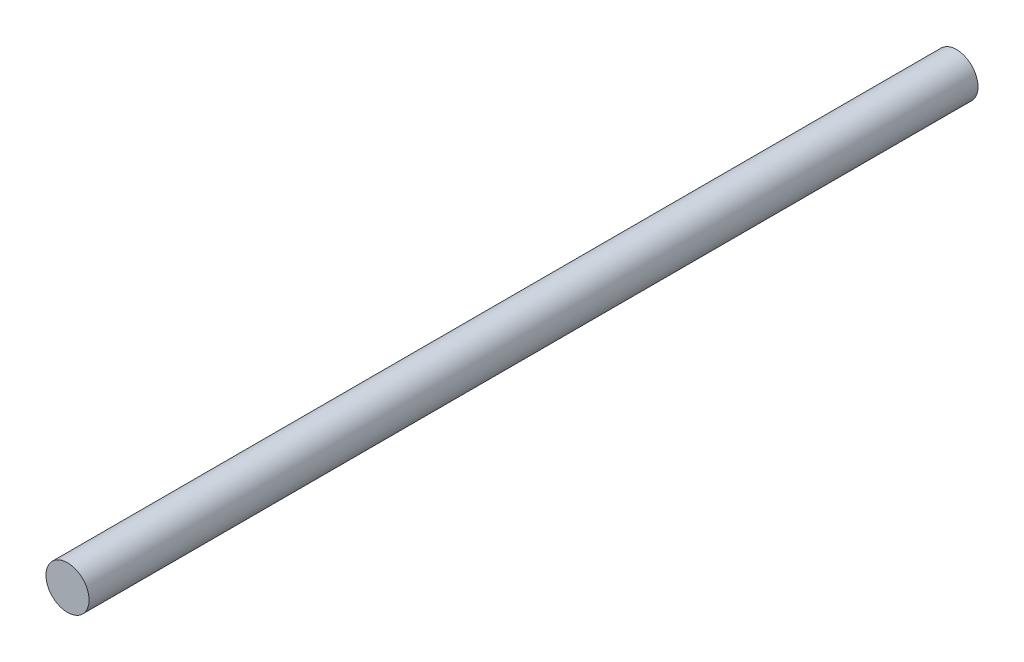
ISO-10303-21;
HEADER;
FILE_DESCRIPTION(('STEP AP214'),'2;1');
FILE_NAME('part.step','',(''),(''),'','','');
FILE_SCHEMA(('AUTOMOTIVE_DESIGN { 1 0 10303 214 1 1 1 1 }'));
ENDSEC;
DATA;
#1=APPLICATION_CONTEXT('core data for automotive mechanical design processes');
#2=APPLICATION_PROTOCOL_DEFINITION('international standard','automotive_design',2000,#1);
#3=PRODUCT_CONTEXT('',#1,'mechanical');
#4=PRODUCT('Part','Part','',(#3));
#5=PRODUCT_RELATED_PRODUCT_CATEGORY('part','',(#4));
#6=PRODUCT_DEFINITION_FORMATION('','',#4);
#7=PRODUCT_DEFINITION_CONTEXT('part definition',#1,'design');
#8=PRODUCT_DEFINITION('design','',#6,#7);
#9=PRODUCT_DEFINITION_SHAPE('','',#8);
#10=(LENGTH_UNIT() NAMED_UNIT(*) SI_UNIT(.MILLI.,.METRE.));
#11=(NAMED_UNIT(*) PLANE_ANGLE_UNIT() SI_UNIT($,.RADIAN.));
#12=(NAMED_UNIT(*) SI_UNIT($,.STERADIAN.) SOLID_ANGLE_UNIT());
#13=UNCERTAINTY_MEASURE_WITH_UNIT(LENGTH_MEASURE(1.E-05),#10,'distance_accuracy_value','');
#14=(GEOMETRIC_REPRESENTATION_CONTEXT(3) GLOBAL_UNCERTAINTY_ASSIGNED_CONTEXT((#13)) GLOBAL_UNIT_ASSIGNED_CONTEXT((#10,
#11,#12)) REPRESENTATION_CONTEXT('',''));
#15=CARTESIAN_POINT('',(0.,0.,0.));
#16=DIRECTION('',(0.,0.,1.));
#17=DIRECTION('',(1.,0.,0.));
#18=AXIS2_PLACEMENT_3D('',#15,#16,#17);
#19=CARTESIAN_POINT('',(0.,0.,82.5));
#20=DIRECTION('',(0.,0.,-1.));
#21=DIRECTION('',(-1.,0.,0.));
#22=AXIS2_PLACEMENT_3D('',#19,#20,#21);
#23=CYLINDRICAL_SURFACE('',#22,4.);
#24=CARTESIAN_POINT('',(0.,0.,82.5));
#25=DIRECTION('',(0.,0.,1.));
#26=DIRECTION('',(1.,0.,0.));
#27=AXIS2_PLACEMENT_3D('',#24,#25,#26);
#28=CIRCLE('',#27,4.);
#29=CARTESIAN_POINT('',(4.,0.,82.5));
#30=VERTEX_POINT('',#29);
#31=EDGE_CURVE('E10',#30,#30,#28,.T.);
#32=ORIENTED_EDGE('',*,*,#31,.F.);
#33=EDGE_LOOP('',(#32));
#34=FACE_BOUND('',#33,.T.);
#35=CARTESIAN_POINT('',(0.,0.,-82.5));
#36=DIRECTION('',(0.,0.,1.));
#37=DIRECTION('',(1.,0.,0.));
#38=AXIS2_PLACEMENT_3D('',#35,#36,#37);
#39=CIRCLE('',#38,4.);
#40=CARTESIAN_POINT('',(4.,0.,-82.5));
#41=VERTEX_POINT('',#40);
#42=EDGE_CURVE('E36',#41,#41,#39,.T.);
#43=ORIENTED_EDGE('',*,*,#42,.T.);
#44=EDGE_LOOP('',(#43));
#45=FACE_BOUND('',#44,.T.);
#46=ADVANCED_FACE('F33',(#34,#45),#23,.T.);
#47=CARTESIAN_POINT('',(0.,0.,82.5));
#48=DIRECTION('',(0.,0.,1.));
#49=DIRECTION('',(1.,0.,0.));
#50=AXIS2_PLACEMENT_3D('',#47,#48,#49);
#51=PLANE('',#50);
#52=ORIENTED_EDGE('',*,*,#31,.T.);
#53=EDGE_LOOP('',(#52));
#54=FACE_BOUND('',#53,.T.);
#55=ADVANCED_FACE('F48',(#54),#51,.T.);
#56=CARTESIAN_POINT('',(0.,0.,-82.5));
#57=DIRECTION('',(0.,0.,1.));
#58=DIRECTION('',(1.,0.,0.));
#59=AXIS2_PLACEMENT_3D('',#56,#57,#58);
#60=PLANE('',#59);
#61=ORIENTED_EDGE('',*,*,#42,.F.);
#62=EDGE_LOOP('',(#61));
#63=FACE_BOUND('',#62,.T.);
#64=ADVANCED_FACE('F46',(#63),#60,.F.);
#65=CLOSED_SHELL('',(#46,#55,#64));
#66=MANIFOLD_SOLID_BREP('B2',#65);
#67=ADVANCED_BREP_SHAPE_REPRESENTATION('',(#18,#66),#14);
#68=SHAPE_DEFINITION_REPRESENTATION(#9,#67);
ENDSEC;
END-ISO-10303-21;
